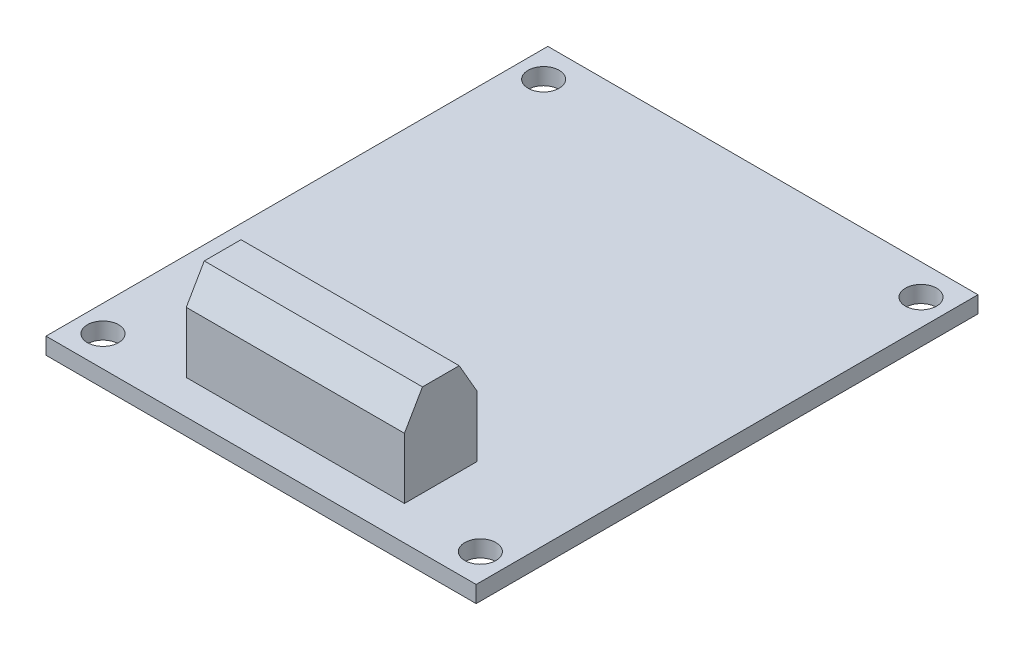
ISO-10303-21;
HEADER;
FILE_DESCRIPTION(('STEP AP214'),'2;1');
FILE_NAME('part.step','',(''),(''),'','','');
FILE_SCHEMA(('AUTOMOTIVE_DESIGN { 1 0 10303 214 1 1 1 1 }'));
ENDSEC;
DATA;
#1=APPLICATION_CONTEXT('core data for automotive mechanical design processes');
#2=APPLICATION_PROTOCOL_DEFINITION('international standard','automotive_design',2000,#1);
#3=PRODUCT_CONTEXT('',#1,'mechanical');
#4=PRODUCT('Part','Part','',(#3));
#5=PRODUCT_RELATED_PRODUCT_CATEGORY('part','',(#4));
#6=PRODUCT_DEFINITION_FORMATION('','',#4);
#7=PRODUCT_DEFINITION_CONTEXT('part definition',#1,'design');
#8=PRODUCT_DEFINITION('design','',#6,#7);
#9=PRODUCT_DEFINITION_SHAPE('','',#8);
#10=(LENGTH_UNIT() NAMED_UNIT(*) SI_UNIT(.MILLI.,.METRE.));
#11=(NAMED_UNIT(*) PLANE_ANGLE_UNIT() SI_UNIT($,.RADIAN.));
#12=(NAMED_UNIT(*) SI_UNIT($,.STERADIAN.) SOLID_ANGLE_UNIT());
#13=UNCERTAINTY_MEASURE_WITH_UNIT(LENGTH_MEASURE(1.E-05),#10,'distance_accuracy_value','');
#14=(GEOMETRIC_REPRESENTATION_CONTEXT(3) GLOBAL_UNCERTAINTY_ASSIGNED_CONTEXT((#13)) GLOBAL_UNIT_ASSIGNED_CONTEXT((#10,
#11,#12)) REPRESENTATION_CONTEXT('',''));
#15=CARTESIAN_POINT('',(0.,0.,0.));
#16=DIRECTION('',(0.,0.,1.));
#17=DIRECTION('',(1.,0.,0.));
#18=AXIS2_PLACEMENT_3D('',#15,#16,#17);
#19=CARTESIAN_POINT('',(0.,1.6,0.));
#20=DIRECTION('',(0.,-1.,0.));
#21=DIRECTION('',(0.,0.,-1.));
#22=AXIS2_PLACEMENT_3D('',#19,#20,#21);
#23=PLANE('',#22);
#24=CARTESIAN_POINT('',(-18.16,1.6,21.205));
#25=DIRECTION('',(0.,1.,0.));
#26=DIRECTION('',(0.,0.,-1.));
#27=AXIS2_PLACEMENT_3D('',#24,#25,#26);
#28=CIRCLE('',#27,1.5);
#29=CARTESIAN_POINT('',(-18.16,1.6,19.705));
#30=VERTEX_POINT('',#29);
#31=EDGE_CURVE('E143',#30,#30,#28,.T.);
#32=ORIENTED_EDGE('',*,*,#31,.F.);
#33=EDGE_LOOP('',(#32));
#34=FACE_BOUND('',#33,.T.);
#35=CARTESIAN_POINT('',(18.16,1.6,21.205));
#36=DIRECTION('',(0.,1.,0.));
#37=DIRECTION('',(0.,0.,1.));
#38=AXIS2_PLACEMENT_3D('',#35,#36,#37);
#39=CIRCLE('',#38,1.5);
#40=CARTESIAN_POINT('',(18.16,1.6,22.705));
#41=VERTEX_POINT('',#40);
#42=EDGE_CURVE('E149',#41,#41,#39,.T.);
#43=ORIENTED_EDGE('',*,*,#42,.F.);
#44=EDGE_LOOP('',(#43));
#45=FACE_BOUND('',#44,.T.);
#46=CARTESIAN_POINT('',(18.16,1.6,-21.205));
#47=DIRECTION('',(0.,1.,0.));
#48=DIRECTION('',(0.,0.,-1.));
#49=AXIS2_PLACEMENT_3D('',#46,#47,#48);
#50=CIRCLE('',#49,1.5);
#51=CARTESIAN_POINT('',(18.16,1.6,-22.705));
#52=VERTEX_POINT('',#51);
#53=EDGE_CURVE('E155',#52,#52,#50,.T.);
#54=ORIENTED_EDGE('',*,*,#53,.F.);
#55=EDGE_LOOP('',(#54));
#56=FACE_BOUND('',#55,.T.);
#57=CARTESIAN_POINT('',(-18.16,1.6,-21.205));
#58=DIRECTION('',(0.,1.,0.));
#59=DIRECTION('',(0.,0.,1.));
#60=AXIS2_PLACEMENT_3D('',#57,#58,#59);
#61=CIRCLE('',#60,1.5);
#62=CARTESIAN_POINT('',(-18.16,1.6,-19.705));
#63=VERTEX_POINT('',#62);
#64=EDGE_CURVE('E161',#63,#63,#61,.T.);
#65=ORIENTED_EDGE('',*,*,#64,.F.);
#66=EDGE_LOOP('',(#65));
#67=FACE_BOUND('',#66,.T.);
#68=DIRECTION('',(0.,0.,1.));
#69=VECTOR('',#68,1.);
#70=CARTESIAN_POINT('',(-20.7,1.6,-24.15));
#71=LINE('',#70,#69);
#72=CARTESIAN_POINT('',(-20.7,1.6,-24.15));
#73=VERTEX_POINT('',#72);
#74=CARTESIAN_POINT('',(-20.7,1.6,24.15));
#75=VERTEX_POINT('',#74);
#76=EDGE_CURVE('E167',#73,#75,#71,.T.);
#77=ORIENTED_EDGE('',*,*,#76,.T.);
#78=DIRECTION('',(1.,0.,0.));
#79=VECTOR('',#78,1.);
#80=CARTESIAN_POINT('',(20.7,1.6,24.15));
#81=LINE('',#80,#79);
#82=CARTESIAN_POINT('',(20.7,1.6,24.15));
#83=VERTEX_POINT('',#82);
#84=EDGE_CURVE('E170',#75,#83,#81,.T.);
#85=ORIENTED_EDGE('',*,*,#84,.T.);
#86=DIRECTION('',(0.,0.,-1.));
#87=VECTOR('',#86,1.);
#88=CARTESIAN_POINT('',(20.7,1.6,-24.15));
#89=LINE('',#88,#87);
#90=CARTESIAN_POINT('',(20.7,1.6,-24.15));
#91=VERTEX_POINT('',#90);
#92=EDGE_CURVE('E173',#83,#91,#89,.T.);
#93=ORIENTED_EDGE('',*,*,#92,.T.);
#94=DIRECTION('',(-1.,0.,0.));
#95=VECTOR('',#94,1.);
#96=CARTESIAN_POINT('',(20.7,1.6,-24.15));
#97=LINE('',#96,#95);
#98=EDGE_CURVE('E175',#91,#73,#97,.T.);
#99=ORIENTED_EDGE('',*,*,#98,.T.);
#100=EDGE_LOOP('',(#77,#85,#93,#99));
#101=FACE_BOUND('',#100,.T.);
#102=DIRECTION('',(0.,0.,-1.));
#103=VECTOR('',#102,1.);
#104=CARTESIAN_POINT('',(10.5,1.6,13.85));
#105=LINE('',#104,#103);
#106=CARTESIAN_POINT('',(10.5,1.6,20.85));
#107=VERTEX_POINT('',#106);
#108=CARTESIAN_POINT('',(10.5,1.6,13.85));
#109=VERTEX_POINT('',#108);
#110=EDGE_CURVE('E111',#107,#109,#105,.T.);
#111=ORIENTED_EDGE('',*,*,#110,.F.);
#112=DIRECTION('',(1.,0.,0.));
#113=VECTOR('',#112,1.);
#114=CARTESIAN_POINT('',(-10.5,1.6,20.85));
#115=LINE('',#114,#113);
#116=CARTESIAN_POINT('',(-10.5,1.6,20.85));
#117=VERTEX_POINT('',#116);
#118=EDGE_CURVE('E122',#117,#107,#115,.T.);
#119=ORIENTED_EDGE('',*,*,#118,.F.);
#120=DIRECTION('',(0.,0.,1.));
#121=VECTOR('',#120,1.);
#122=CARTESIAN_POINT('',(-10.5,1.6,13.85));
#123=LINE('',#122,#121);
#124=CARTESIAN_POINT('',(-10.5,1.6,13.85));
#125=VERTEX_POINT('',#124);
#126=EDGE_CURVE('E130',#125,#117,#123,.T.);
#127=ORIENTED_EDGE('',*,*,#126,.F.);
#128=DIRECTION('',(-1.,0.,0.));
#129=VECTOR('',#128,1.);
#130=CARTESIAN_POINT('',(-10.5,1.6,13.85));
#131=LINE('',#130,#129);
#132=EDGE_CURVE('E125',#109,#125,#131,.T.);
#133=ORIENTED_EDGE('',*,*,#132,.F.);
#134=EDGE_LOOP('',(#111,#119,#127,#133));
#135=FACE_BOUND('',#134,.T.);
#136=ADVANCED_FACE('F33',(#34,#45,#56,#67,#101,#135),#23,.F.);
#137=CARTESIAN_POINT('',(0.,0.,0.));
#138=DIRECTION('',(0.,-1.,0.));
#139=DIRECTION('',(0.,0.,-1.));
#140=AXIS2_PLACEMENT_3D('',#137,#138,#139);
#141=PLANE('',#140);
#142=CARTESIAN_POINT('',(18.16,0.,21.205));
#143=DIRECTION('',(0.,1.,0.));
#144=DIRECTION('',(0.,0.,1.));
#145=AXIS2_PLACEMENT_3D('',#142,#143,#144);
#146=CIRCLE('',#145,1.5);
#147=CARTESIAN_POINT('',(18.16,0.,22.705));
#148=VERTEX_POINT('',#147);
#149=EDGE_CURVE('E146',#148,#148,#146,.T.);
#150=ORIENTED_EDGE('',*,*,#149,.T.);
#151=EDGE_LOOP('',(#150));
#152=FACE_BOUND('',#151,.T.);
#153=CARTESIAN_POINT('',(-18.16,0.,-21.205));
#154=DIRECTION('',(0.,1.,0.));
#155=DIRECTION('',(0.,0.,1.));
#156=AXIS2_PLACEMENT_3D('',#153,#154,#155);
#157=CIRCLE('',#156,1.5);
#158=CARTESIAN_POINT('',(-18.16,0.,-19.705));
#159=VERTEX_POINT('',#158);
#160=EDGE_CURVE('E158',#159,#159,#157,.T.);
#161=ORIENTED_EDGE('',*,*,#160,.T.);
#162=EDGE_LOOP('',(#161));
#163=FACE_BOUND('',#162,.T.);
#164=DIRECTION('',(0.,0.,1.));
#165=VECTOR('',#164,1.);
#166=CARTESIAN_POINT('',(-20.7,0.,-24.15));
#167=LINE('',#166,#165);
#168=CARTESIAN_POINT('',(-20.7,0.,-24.15));
#169=VERTEX_POINT('',#168);
#170=CARTESIAN_POINT('',(-20.7,0.,24.15));
#171=VERTEX_POINT('',#170);
#172=EDGE_CURVE('E164',#169,#171,#167,.T.);
#173=ORIENTED_EDGE('',*,*,#172,.F.);
#174=DIRECTION('',(-1.,0.,0.));
#175=VECTOR('',#174,1.);
#176=CARTESIAN_POINT('',(20.7,0.,-24.15));
#177=LINE('',#176,#175);
#178=CARTESIAN_POINT('',(20.7,0.,-24.15));
#179=VERTEX_POINT('',#178);
#180=EDGE_CURVE('E171',#179,#169,#177,.T.);
#181=ORIENTED_EDGE('',*,*,#180,.F.);
#182=DIRECTION('',(0.,0.,-1.));
#183=VECTOR('',#182,1.);
#184=CARTESIAN_POINT('',(20.7,0.,-24.15));
#185=LINE('',#184,#183);
#186=CARTESIAN_POINT('',(20.7,0.,24.15));
#187=VERTEX_POINT('',#186);
#188=EDGE_CURVE('E182',#187,#179,#185,.T.);
#189=ORIENTED_EDGE('',*,*,#188,.F.);
#190=DIRECTION('',(1.,0.,0.));
#191=VECTOR('',#190,1.);
#192=CARTESIAN_POINT('',(20.7,0.,24.15));
#193=LINE('',#192,#191);
#194=EDGE_CURVE('E180',#171,#187,#193,.T.);
#195=ORIENTED_EDGE('',*,*,#194,.F.);
#196=EDGE_LOOP('',(#173,#181,#189,#195));
#197=FACE_BOUND('',#196,.T.);
#198=CARTESIAN_POINT('',(18.16,0.,-21.205));
#199=DIRECTION('',(0.,1.,0.));
#200=DIRECTION('',(0.,0.,-1.));
#201=AXIS2_PLACEMENT_3D('',#198,#199,#200);
#202=CIRCLE('',#201,1.5);
#203=CARTESIAN_POINT('',(18.16,0.,-22.705));
#204=VERTEX_POINT('',#203);
#205=EDGE_CURVE('E152',#204,#204,#202,.T.);
#206=ORIENTED_EDGE('',*,*,#205,.T.);
#207=EDGE_LOOP('',(#206));
#208=FACE_BOUND('',#207,.T.);
#209=CARTESIAN_POINT('',(-18.16,0.,21.205));
#210=DIRECTION('',(0.,1.,0.));
#211=DIRECTION('',(0.,0.,-1.));
#212=AXIS2_PLACEMENT_3D('',#209,#210,#211);
#213=CIRCLE('',#212,1.5);
#214=CARTESIAN_POINT('',(-18.16,0.,19.705));
#215=VERTEX_POINT('',#214);
#216=EDGE_CURVE('E142',#215,#215,#213,.T.);
#217=ORIENTED_EDGE('',*,*,#216,.T.);
#218=EDGE_LOOP('',(#217));
#219=FACE_BOUND('',#218,.T.);
#220=ADVANCED_FACE('F227',(#152,#163,#197,#208,#219),#141,.T.);
#221=CARTESIAN_POINT('',(-20.7,1.6,-24.15));
#222=DIRECTION('',(1.,0.,0.));
#223=DIRECTION('',(0.,0.,-1.));
#224=AXIS2_PLACEMENT_3D('',#221,#222,#223);
#225=PLANE('',#224);
#226=ORIENTED_EDGE('',*,*,#172,.T.);
#227=DIRECTION('',(0.,-1.,0.));
#228=VECTOR('',#227,1.);
#229=CARTESIAN_POINT('',(-20.7,1.6,24.15));
#230=LINE('',#229,#228);
#231=EDGE_CURVE('E193',#75,#171,#230,.T.);
#232=ORIENTED_EDGE('',*,*,#231,.F.);
#233=ORIENTED_EDGE('',*,*,#76,.F.);
#234=DIRECTION('',(0.,-1.,0.));
#235=VECTOR('',#234,1.);
#236=CARTESIAN_POINT('',(-20.7,1.6,-24.15));
#237=LINE('',#236,#235);
#238=EDGE_CURVE('E177',#73,#169,#237,.T.);
#239=ORIENTED_EDGE('',*,*,#238,.T.);
#240=EDGE_LOOP('',(#226,#232,#233,#239));
#241=FACE_BOUND('',#240,.T.);
#242=ADVANCED_FACE('F235',(#241),#225,.F.);
#243=CARTESIAN_POINT('',(20.7,1.6,24.15));
#244=DIRECTION('',(0.,0.,-1.));
#245=DIRECTION('',(-1.,0.,0.));
#246=AXIS2_PLACEMENT_3D('',#243,#244,#245);
#247=PLANE('',#246);
#248=ORIENTED_EDGE('',*,*,#194,.T.);
#249=DIRECTION('',(0.,-1.,0.));
#250=VECTOR('',#249,1.);
#251=CARTESIAN_POINT('',(20.7,1.6,24.15));
#252=LINE('',#251,#250);
#253=EDGE_CURVE('E190',#83,#187,#252,.T.);
#254=ORIENTED_EDGE('',*,*,#253,.F.);
#255=ORIENTED_EDGE('',*,*,#84,.F.);
#256=ORIENTED_EDGE('',*,*,#231,.T.);
#257=EDGE_LOOP('',(#248,#254,#255,#256));
#258=FACE_BOUND('',#257,.T.);
#259=ADVANCED_FACE('F251',(#258),#247,.F.);
#260=CARTESIAN_POINT('',(20.7,1.6,-24.15));
#261=DIRECTION('',(-1.,0.,0.));
#262=DIRECTION('',(0.,0.,1.));
#263=AXIS2_PLACEMENT_3D('',#260,#261,#262);
#264=PLANE('',#263);
#265=ORIENTED_EDGE('',*,*,#188,.T.);
#266=DIRECTION('',(0.,-1.,0.));
#267=VECTOR('',#266,1.);
#268=CARTESIAN_POINT('',(20.7,1.6,-24.15));
#269=LINE('',#268,#267);
#270=EDGE_CURVE('E187',#91,#179,#269,.T.);
#271=ORIENTED_EDGE('',*,*,#270,.F.);
#272=ORIENTED_EDGE('',*,*,#92,.F.);
#273=ORIENTED_EDGE('',*,*,#253,.T.);
#274=EDGE_LOOP('',(#265,#271,#272,#273));
#275=FACE_BOUND('',#274,.T.);
#276=ADVANCED_FACE('F247',(#275),#264,.F.);
#277=CARTESIAN_POINT('',(20.7,1.6,-24.15));
#278=DIRECTION('',(0.,0.,1.));
#279=DIRECTION('',(1.,0.,0.));
#280=AXIS2_PLACEMENT_3D('',#277,#278,#279);
#281=PLANE('',#280);
#282=ORIENTED_EDGE('',*,*,#180,.T.);
#283=ORIENTED_EDGE('',*,*,#238,.F.);
#284=ORIENTED_EDGE('',*,*,#98,.F.);
#285=ORIENTED_EDGE('',*,*,#270,.T.);
#286=EDGE_LOOP('',(#282,#283,#284,#285));
#287=FACE_BOUND('',#286,.T.);
#288=ADVANCED_FACE('F244',(#287),#281,.F.);
#289=CARTESIAN_POINT('',(-18.16,1.6,-21.205));
#290=DIRECTION('',(0.,-1.,0.));
#291=DIRECTION('',(0.,0.,-1.));
#292=AXIS2_PLACEMENT_3D('',#289,#290,#291);
#293=CYLINDRICAL_SURFACE('',#292,1.5);
#294=ORIENTED_EDGE('',*,*,#64,.T.);
#295=EDGE_LOOP('',(#294));
#296=FACE_BOUND('',#295,.T.);
#297=ORIENTED_EDGE('',*,*,#160,.F.);
#298=EDGE_LOOP('',(#297));
#299=FACE_BOUND('',#298,.T.);
#300=ADVANCED_FACE('F241',(#296,#299),#293,.F.);
#301=CARTESIAN_POINT('',(18.16,1.6,-21.205));
#302=DIRECTION('',(0.,-1.,0.));
#303=DIRECTION('',(0.,0.,-1.));
#304=AXIS2_PLACEMENT_3D('',#301,#302,#303);
#305=CYLINDRICAL_SURFACE('',#304,1.5);
#306=ORIENTED_EDGE('',*,*,#53,.T.);
#307=EDGE_LOOP('',(#306));
#308=FACE_BOUND('',#307,.T.);
#309=ORIENTED_EDGE('',*,*,#205,.F.);
#310=EDGE_LOOP('',(#309));
#311=FACE_BOUND('',#310,.T.);
#312=ADVANCED_FACE('F287',(#308,#311),#305,.F.);
#313=CARTESIAN_POINT('',(18.16,1.6,21.205));
#314=DIRECTION('',(0.,-1.,0.));
#315=DIRECTION('',(0.,0.,-1.));
#316=AXIS2_PLACEMENT_3D('',#313,#314,#315);
#317=CYLINDRICAL_SURFACE('',#316,1.5);
#318=ORIENTED_EDGE('',*,*,#42,.T.);
#319=EDGE_LOOP('',(#318));
#320=FACE_BOUND('',#319,.T.);
#321=ORIENTED_EDGE('',*,*,#149,.F.);
#322=EDGE_LOOP('',(#321));
#323=FACE_BOUND('',#322,.T.);
#324=ADVANCED_FACE('F279',(#320,#323),#317,.F.);
#325=CARTESIAN_POINT('',(-18.16,1.6,21.205));
#326=DIRECTION('',(0.,-1.,0.));
#327=DIRECTION('',(0.,0.,-1.));
#328=AXIS2_PLACEMENT_3D('',#325,#326,#327);
#329=CYLINDRICAL_SURFACE('',#328,1.5);
#330=ORIENTED_EDGE('',*,*,#31,.T.);
#331=EDGE_LOOP('',(#330));
#332=FACE_BOUND('',#331,.T.);
#333=ORIENTED_EDGE('',*,*,#216,.F.);
#334=EDGE_LOOP('',(#333));
#335=FACE_BOUND('',#334,.T.);
#336=ADVANCED_FACE('F277',(#332,#335),#329,.F.);
#337=CARTESIAN_POINT('',(10.5,10.45,13.85));
#338=DIRECTION('',(-1.,0.,0.));
#339=DIRECTION('',(0.,0.,1.));
#340=AXIS2_PLACEMENT_3D('',#337,#338,#339);
#341=PLANE('',#340);
#342=DIRECTION('',(0.,-1.,0.));
#343=VECTOR('',#342,1.);
#344=CARTESIAN_POINT('',(10.5,10.45,13.85));
#345=LINE('',#344,#343);
#346=CARTESIAN_POINT('',(10.5,7.44999999999998,13.85));
#347=VERTEX_POINT('',#346);
#348=EDGE_CURVE('E140',#347,#109,#345,.T.);
#349=ORIENTED_EDGE('',*,*,#348,.F.);
#350=DIRECTION('',(0.,0.86602540378444,0.499999999999998));
#351=VECTOR('',#350,1.);
#352=CARTESIAN_POINT('',(10.5,10.45,15.5820508075689));
#353=LINE('',#352,#351);
#354=CARTESIAN_POINT('',(10.5,10.45,15.5820508075689));
#355=VERTEX_POINT('',#354);
#356=EDGE_CURVE('E41',#347,#355,#353,.T.);
#357=ORIENTED_EDGE('',*,*,#356,.T.);
#358=DIRECTION('',(0.,0.,-1.));
#359=VECTOR('',#358,1.);
#360=CARTESIAN_POINT('',(10.5,10.45,13.85));
#361=LINE('',#360,#359);
#362=CARTESIAN_POINT('',(10.5,10.45,19.1179491924311));
#363=VERTEX_POINT('',#362);
#364=EDGE_CURVE('E129',#363,#355,#361,.T.);
#365=ORIENTED_EDGE('',*,*,#364,.F.);
#366=DIRECTION('',(0.,-0.86602540378444,0.499999999999998));
#367=VECTOR('',#366,1.);
#368=CARTESIAN_POINT('',(10.5,10.45,19.1179491924311));
#369=LINE('',#368,#367);
#370=CARTESIAN_POINT('',(10.5,7.44999999999998,20.85));
#371=VERTEX_POINT('',#370);
#372=EDGE_CURVE('E48',#363,#371,#369,.T.);
#373=ORIENTED_EDGE('',*,*,#372,.T.);
#374=DIRECTION('',(0.,-1.,0.));
#375=VECTOR('',#374,1.);
#376=CARTESIAN_POINT('',(10.5,10.45,20.85));
#377=LINE('',#376,#375);
#378=EDGE_CURVE('E108',#371,#107,#377,.T.);
#379=ORIENTED_EDGE('',*,*,#378,.T.);
#380=ORIENTED_EDGE('',*,*,#110,.T.);
#381=EDGE_LOOP('',(#349,#357,#365,#373,#379,#380));
#382=FACE_BOUND('',#381,.T.);
#383=ADVANCED_FACE('F110',(#382),#341,.F.);
#384=CARTESIAN_POINT('',(-10.5,10.45,13.85));
#385=DIRECTION('',(0.,0.,1.));
#386=DIRECTION('',(1.,0.,0.));
#387=AXIS2_PLACEMENT_3D('',#384,#385,#386);
#388=PLANE('',#387);
#389=DIRECTION('',(0.,-1.,0.));
#390=VECTOR('',#389,1.);
#391=CARTESIAN_POINT('',(-10.5,10.45,13.85));
#392=LINE('',#391,#390);
#393=CARTESIAN_POINT('',(-10.5,7.44999999999998,13.85));
#394=VERTEX_POINT('',#393);
#395=EDGE_CURVE('E138',#394,#125,#392,.T.);
#396=ORIENTED_EDGE('',*,*,#395,.F.);
#397=DIRECTION('',(1.,0.,0.));
#398=VECTOR('',#397,1.);
#399=CARTESIAN_POINT('',(10.5,7.44999999999998,13.85));
#400=LINE('',#399,#398);
#401=EDGE_CURVE('E56',#394,#347,#400,.T.);
#402=ORIENTED_EDGE('',*,*,#401,.T.);
#403=ORIENTED_EDGE('',*,*,#348,.T.);
#404=ORIENTED_EDGE('',*,*,#132,.T.);
#405=EDGE_LOOP('',(#396,#402,#403,#404));
#406=FACE_BOUND('',#405,.T.);
#407=ADVANCED_FACE('F218',(#406),#388,.F.);
#408=CARTESIAN_POINT('',(-10.5,10.45,13.85));
#409=DIRECTION('',(1.,0.,0.));
#410=DIRECTION('',(0.,0.,-1.));
#411=AXIS2_PLACEMENT_3D('',#408,#409,#410);
#412=PLANE('',#411);
#413=DIRECTION('',(0.,0.,1.));
#414=VECTOR('',#413,1.);
#415=CARTESIAN_POINT('',(-10.5,10.45,13.85));
#416=LINE('',#415,#414);
#417=CARTESIAN_POINT('',(-10.5,10.45,15.5820508075689));
#418=VERTEX_POINT('',#417);
#419=CARTESIAN_POINT('',(-10.5,10.45,19.1179491924311));
#420=VERTEX_POINT('',#419);
#421=EDGE_CURVE('E116',#418,#420,#416,.T.);
#422=ORIENTED_EDGE('',*,*,#421,.F.);
#423=DIRECTION('',(0.,-0.86602540378444,-0.499999999999998));
#424=VECTOR('',#423,1.);
#425=CARTESIAN_POINT('',(-10.5,10.45,15.5820508075689));
#426=LINE('',#425,#424);
#427=EDGE_CURVE('E204',#418,#394,#426,.T.);
#428=ORIENTED_EDGE('',*,*,#427,.T.);
#429=ORIENTED_EDGE('',*,*,#395,.T.);
#430=ORIENTED_EDGE('',*,*,#126,.T.);
#431=DIRECTION('',(0.,-1.,0.));
#432=VECTOR('',#431,1.);
#433=CARTESIAN_POINT('',(-10.5,10.45,20.85));
#434=LINE('',#433,#432);
#435=CARTESIAN_POINT('',(-10.5,7.44999999999998,20.85));
#436=VERTEX_POINT('',#435);
#437=EDGE_CURVE('E115',#436,#117,#434,.T.);
#438=ORIENTED_EDGE('',*,*,#437,.F.);
#439=DIRECTION('',(0.,0.86602540378444,-0.499999999999998));
#440=VECTOR('',#439,1.);
#441=CARTESIAN_POINT('',(-10.5,10.45,19.1179491924311));
#442=LINE('',#441,#440);
#443=EDGE_CURVE('E202',#436,#420,#442,.T.);
#444=ORIENTED_EDGE('',*,*,#443,.T.);
#445=EDGE_LOOP('',(#422,#428,#429,#430,#438,#444));
#446=FACE_BOUND('',#445,.T.);
#447=ADVANCED_FACE('F217',(#446),#412,.F.);
#448=CARTESIAN_POINT('',(-10.5,10.45,20.85));
#449=DIRECTION('',(0.,0.,-1.));
#450=DIRECTION('',(-1.,0.,0.));
#451=AXIS2_PLACEMENT_3D('',#448,#449,#450);
#452=PLANE('',#451);
#453=ORIENTED_EDGE('',*,*,#378,.F.);
#454=DIRECTION('',(-1.,0.,0.));
#455=VECTOR('',#454,1.);
#456=CARTESIAN_POINT('',(-10.5,7.44999999999998,20.85));
#457=LINE('',#456,#455);
#458=EDGE_CURVE('E11',#371,#436,#457,.T.);
#459=ORIENTED_EDGE('',*,*,#458,.T.);
#460=ORIENTED_EDGE('',*,*,#437,.T.);
#461=ORIENTED_EDGE('',*,*,#118,.T.);
#462=EDGE_LOOP('',(#453,#459,#460,#461));
#463=FACE_BOUND('',#462,.T.);
#464=ADVANCED_FACE('F127',(#463),#452,.F.);
#465=CARTESIAN_POINT('',(0.,10.45,0.));
#466=DIRECTION('',(0.,1.,0.));
#467=DIRECTION('',(0.,0.,1.));
#468=AXIS2_PLACEMENT_3D('',#465,#466,#467);
#469=PLANE('',#468);
#470=ORIENTED_EDGE('',*,*,#364,.T.);
#471=DIRECTION('',(-1.,0.,0.));
#472=VECTOR('',#471,1.);
#473=CARTESIAN_POINT('',(-10.5,10.45,15.5820508075689));
#474=LINE('',#473,#472);
#475=EDGE_CURVE('E199',#355,#418,#474,.T.);
#476=ORIENTED_EDGE('',*,*,#475,.T.);
#477=ORIENTED_EDGE('',*,*,#421,.T.);
#478=DIRECTION('',(1.,0.,0.));
#479=VECTOR('',#478,1.);
#480=CARTESIAN_POINT('',(10.5,10.45,19.1179491924311));
#481=LINE('',#480,#479);
#482=EDGE_CURVE('E196',#420,#363,#481,.T.);
#483=ORIENTED_EDGE('',*,*,#482,.T.);
#484=EDGE_LOOP('',(#470,#476,#477,#483));
#485=FACE_BOUND('',#484,.T.);
#486=ADVANCED_FACE('F211',(#485),#469,.T.);
#487=CARTESIAN_POINT('',(0.,10.45,15.5820508075689));
#488=DIRECTION('',(0.,0.499999999999998,-0.86602540378444));
#489=DIRECTION('',(1.,0.,0.));
#490=AXIS2_PLACEMENT_3D('',#487,#488,#489);
#491=PLANE('',#490);
#492=ORIENTED_EDGE('',*,*,#356,.F.);
#493=ORIENTED_EDGE('',*,*,#401,.F.);
#494=ORIENTED_EDGE('',*,*,#427,.F.);
#495=ORIENTED_EDGE('',*,*,#475,.F.);
#496=EDGE_LOOP('',(#492,#493,#494,#495));
#497=FACE_BOUND('',#496,.T.);
#498=ADVANCED_FACE('F215',(#497),#491,.T.);
#499=CARTESIAN_POINT('',(0.,10.45,19.1179491924311));
#500=DIRECTION('',(0.,0.499999999999998,0.86602540378444));
#501=DIRECTION('',(-1.,0.,0.));
#502=AXIS2_PLACEMENT_3D('',#499,#500,#501);
#503=PLANE('',#502);
#504=ORIENTED_EDGE('',*,*,#443,.F.);
#505=ORIENTED_EDGE('',*,*,#458,.F.);
#506=ORIENTED_EDGE('',*,*,#372,.F.);
#507=ORIENTED_EDGE('',*,*,#482,.F.);
#508=EDGE_LOOP('',(#504,#505,#506,#507));
#509=FACE_BOUND('',#508,.T.);
#510=ADVANCED_FACE('F35',(#509),#503,.T.);
#511=CLOSED_SHELL('',(#136,#220,#242,#259,#276,#288,#300,#312,#324,#336,#383,#407,#447,#464,
#486,#498,#510));
#512=MANIFOLD_SOLID_BREP('B2',#511);
#513=ADVANCED_BREP_SHAPE_REPRESENTATION('',(#18,#512),#14);
#514=SHAPE_DEFINITION_REPRESENTATION(#9,#513);
ENDSEC;
END-ISO-10303-21;
